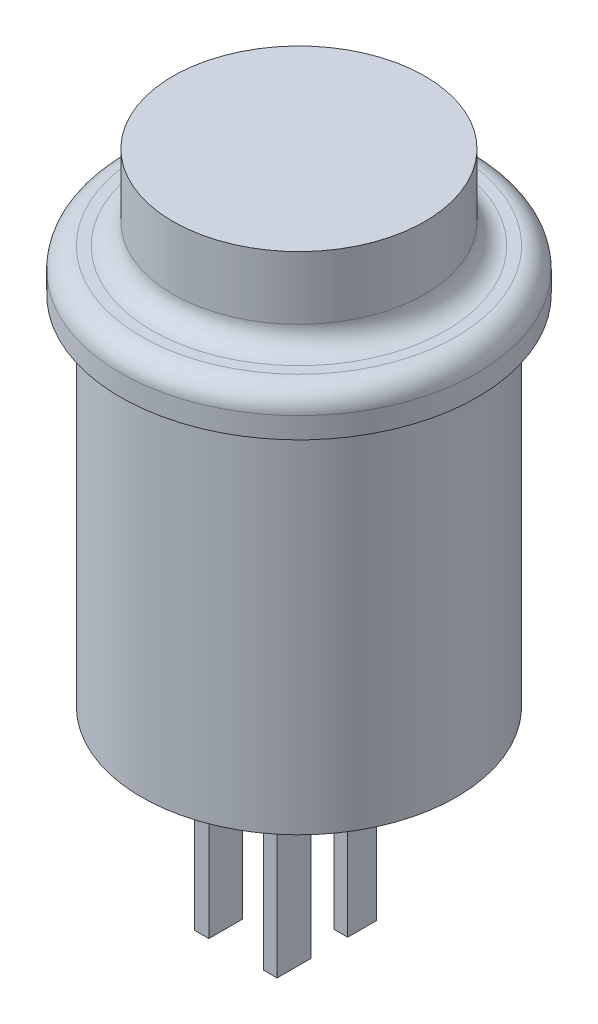
ISO-10303-21;
HEADER;
FILE_DESCRIPTION(('STEP AP214'),'2;1');
FILE_NAME('part.step','',(''),(''),'','','');
FILE_SCHEMA(('AUTOMOTIVE_DESIGN { 1 0 10303 214 1 1 1 1 }'));
ENDSEC;
DATA;
#1=APPLICATION_CONTEXT('core data for automotive mechanical design processes');
#2=APPLICATION_PROTOCOL_DEFINITION('international standard','automotive_design',2000,#1);
#3=PRODUCT_CONTEXT('',#1,'mechanical');
#4=PRODUCT('Part','Part','',(#3));
#5=PRODUCT_RELATED_PRODUCT_CATEGORY('part','',(#4));
#6=PRODUCT_DEFINITION_FORMATION('','',#4);
#7=PRODUCT_DEFINITION_CONTEXT('part definition',#1,'design');
#8=PRODUCT_DEFINITION('design','',#6,#7);
#9=PRODUCT_DEFINITION_SHAPE('','',#8);
#10=(LENGTH_UNIT() NAMED_UNIT(*) SI_UNIT(.MILLI.,.METRE.));
#11=(NAMED_UNIT(*) PLANE_ANGLE_UNIT() SI_UNIT($,.RADIAN.));
#12=(NAMED_UNIT(*) SI_UNIT($,.STERADIAN.) SOLID_ANGLE_UNIT());
#13=UNCERTAINTY_MEASURE_WITH_UNIT(LENGTH_MEASURE(1.E-05),#10,'distance_accuracy_value','');
#14=(GEOMETRIC_REPRESENTATION_CONTEXT(3) GLOBAL_UNCERTAINTY_ASSIGNED_CONTEXT((#13)) GLOBAL_UNIT_ASSIGNED_CONTEXT((#10,
#11,#12)) REPRESENTATION_CONTEXT('',''));
#15=CARTESIAN_POINT('',(0.,0.,0.));
#16=DIRECTION('',(0.,0.,1.));
#17=DIRECTION('',(1.,0.,0.));
#18=AXIS2_PLACEMENT_3D('',#15,#16,#17);
#19=CARTESIAN_POINT('',(0.,-19.,0.));
#20=DIRECTION('',(0.,-1.,0.));
#21=DIRECTION('',(0.,0.,-1.));
#22=AXIS2_PLACEMENT_3D('',#19,#20,#21);
#23=PLANE('',#22);
#24=CARTESIAN_POINT('',(0.,-19.,0.));
#25=DIRECTION('',(0.,-1.,0.));
#26=DIRECTION('',(0.,0.,-1.));
#27=AXIS2_PLACEMENT_3D('',#24,#25,#26);
#28=CIRCLE('',#27,7.5);
#29=CARTESIAN_POINT('',(0.,-19.,-7.5));
#30=VERTEX_POINT('',#29);
#31=EDGE_CURVE('E266',#30,#30,#28,.T.);
#32=ORIENTED_EDGE('',*,*,#31,.T.);
#33=EDGE_LOOP('',(#32));
#34=FACE_BOUND('',#33,.T.);
#35=DIRECTION('',(1.,0.,0.));
#36=VECTOR('',#35,1.);
#37=CARTESIAN_POINT('',(3.03160326075695,-19.,3.12291661198465));
#38=LINE('',#37,#36);
#39=CARTESIAN_POINT('',(3.03160326075695,-19.,3.12291661198465));
#40=VERTEX_POINT('',#39);
#41=CARTESIAN_POINT('',(3.6890593895958,-19.,3.12291661198465));
#42=VERTEX_POINT('',#41);
#43=EDGE_CURVE('E250',#40,#42,#38,.T.);
#44=ORIENTED_EDGE('',*,*,#43,.F.);
#45=DIRECTION('',(0.,0.,-1.));
#46=VECTOR('',#45,1.);
#47=CARTESIAN_POINT('',(3.03160326075695,-19.,4.73003159359074));
#48=LINE('',#47,#46);
#49=CARTESIAN_POINT('',(3.03160326075695,-19.,4.73003159359074));
#50=VERTEX_POINT('',#49);
#51=EDGE_CURVE('E236',#50,#40,#48,.T.);
#52=ORIENTED_EDGE('',*,*,#51,.F.);
#53=DIRECTION('',(-1.,0.,0.));
#54=VECTOR('',#53,1.);
#55=CARTESIAN_POINT('',(3.03160326075695,-19.,4.73003159359074));
#56=LINE('',#55,#54);
#57=CARTESIAN_POINT('',(3.6890593895958,-19.,4.73003159359074));
#58=VERTEX_POINT('',#57);
#59=EDGE_CURVE('E241',#58,#50,#56,.T.);
#60=ORIENTED_EDGE('',*,*,#59,.F.);
#61=DIRECTION('',(0.,0.,1.));
#62=VECTOR('',#61,1.);
#63=CARTESIAN_POINT('',(3.6890593895958,-19.,4.73003159359074));
#64=LINE('',#63,#62);
#65=EDGE_CURVE('E252',#42,#58,#64,.T.);
#66=ORIENTED_EDGE('',*,*,#65,.F.);
#67=EDGE_LOOP('',(#44,#52,#60,#66));
#68=FACE_BOUND('',#67,.T.);
#69=DIRECTION('',(1.,0.,0.));
#70=VECTOR('',#69,1.);
#71=CARTESIAN_POINT('',(-0.255677383437333,-19.,3.12291661198465));
#72=LINE('',#71,#70);
#73=CARTESIAN_POINT('',(-0.255677383437333,-19.,3.12291661198465));
#74=VERTEX_POINT('',#73);
#75=CARTESIAN_POINT('',(0.438304085892571,-19.,3.12291661198465));
#76=VERTEX_POINT('',#75);
#77=EDGE_CURVE('E221',#74,#76,#72,.T.);
#78=ORIENTED_EDGE('',*,*,#77,.F.);
#79=DIRECTION('',(0.,0.,-1.));
#80=VECTOR('',#79,1.);
#81=CARTESIAN_POINT('',(-0.255677383437333,-19.,4.73003159359074));
#82=LINE('',#81,#80);
#83=CARTESIAN_POINT('',(-0.255677383437333,-19.,4.73003159359074));
#84=VERTEX_POINT('',#83);
#85=EDGE_CURVE('E207',#84,#74,#82,.T.);
#86=ORIENTED_EDGE('',*,*,#85,.F.);
#87=DIRECTION('',(-1.,0.,0.));
#88=VECTOR('',#87,1.);
#89=CARTESIAN_POINT('',(-0.255677383437333,-19.,4.73003159359074));
#90=LINE('',#89,#88);
#91=CARTESIAN_POINT('',(0.438304085892571,-19.,4.73003159359074));
#92=VERTEX_POINT('',#91);
#93=EDGE_CURVE('E212',#92,#84,#90,.T.);
#94=ORIENTED_EDGE('',*,*,#93,.F.);
#95=DIRECTION('',(0.,0.,1.));
#96=VECTOR('',#95,1.);
#97=CARTESIAN_POINT('',(0.438304085892571,-19.,4.73003159359074));
#98=LINE('',#97,#96);
#99=EDGE_CURVE('E223',#76,#92,#98,.T.);
#100=ORIENTED_EDGE('',*,*,#99,.F.);
#101=EDGE_LOOP('',(#78,#86,#94,#100));
#102=FACE_BOUND('',#101,.T.);
#103=DIRECTION('',(1.,0.,0.));
#104=VECTOR('',#103,1.);
#105=CARTESIAN_POINT('',(3.03160326075695,-19.,0.));
#106=LINE('',#105,#104);
#107=CARTESIAN_POINT('',(3.03160326075695,-19.,0.));
#108=VERTEX_POINT('',#107);
#109=CARTESIAN_POINT('',(3.6890593895958,-19.,0.));
#110=VERTEX_POINT('',#109);
#111=EDGE_CURVE('E179',#108,#110,#106,.T.);
#112=ORIENTED_EDGE('',*,*,#111,.F.);
#113=DIRECTION('',(0.,0.,-1.));
#114=VECTOR('',#113,1.);
#115=CARTESIAN_POINT('',(3.03160326075695,-19.,1.36970026841437));
#116=LINE('',#115,#114);
#117=CARTESIAN_POINT('',(3.03160326075695,-19.,1.36970026841437));
#118=VERTEX_POINT('',#117);
#119=EDGE_CURVE('E176',#118,#108,#116,.T.);
#120=ORIENTED_EDGE('',*,*,#119,.F.);
#121=DIRECTION('',(-1.,0.,0.));
#122=VECTOR('',#121,1.);
#123=CARTESIAN_POINT('',(3.03160326075695,-19.,1.36970026841437));
#124=LINE('',#123,#122);
#125=CARTESIAN_POINT('',(3.6890593895958,-19.,1.36970026841437));
#126=VERTEX_POINT('',#125);
#127=EDGE_CURVE('E188',#126,#118,#124,.T.);
#128=ORIENTED_EDGE('',*,*,#127,.F.);
#129=DIRECTION('',(0.,0.,1.));
#130=VECTOR('',#129,1.);
#131=CARTESIAN_POINT('',(3.6890593895958,-19.,1.36970026841437));
#132=LINE('',#131,#130);
#133=EDGE_CURVE('E196',#110,#126,#132,.T.);
#134=ORIENTED_EDGE('',*,*,#133,.F.);
#135=EDGE_LOOP('',(#112,#120,#128,#134));
#136=FACE_BOUND('',#135,.T.);
#137=DIRECTION('',(1.,0.,0.));
#138=VECTOR('',#137,1.);
#139=CARTESIAN_POINT('',(-0.255677383437333,-19.,0.));
#140=LINE('',#139,#138);
#141=CARTESIAN_POINT('',(-0.255677383437333,-19.,0.));
#142=VERTEX_POINT('',#141);
#143=CARTESIAN_POINT('',(0.438304085892571,-19.,0.));
#144=VERTEX_POINT('',#143);
#145=EDGE_CURVE('E580',#142,#144,#140,.T.);
#146=ORIENTED_EDGE('',*,*,#145,.F.);
#147=DIRECTION('',(0.,0.,-1.));
#148=VECTOR('',#147,1.);
#149=CARTESIAN_POINT('',(-0.255677383437333,-19.,1.36970026841437));
#150=LINE('',#149,#148);
#151=CARTESIAN_POINT('',(-0.255677383437333,-19.,1.36970026841437));
#152=VERTEX_POINT('',#151);
#153=EDGE_CURVE('E174',#152,#142,#150,.T.);
#154=ORIENTED_EDGE('',*,*,#153,.F.);
#155=DIRECTION('',(-1.,0.,0.));
#156=VECTOR('',#155,1.);
#157=CARTESIAN_POINT('',(-0.255677383437333,-19.,1.36970026841437));
#158=LINE('',#157,#156);
#159=CARTESIAN_POINT('',(0.438304085892571,-19.,1.36970026841437));
#160=VERTEX_POINT('',#159);
#161=EDGE_CURVE('E170',#160,#152,#158,.T.);
#162=ORIENTED_EDGE('',*,*,#161,.F.);
#163=DIRECTION('',(0.,0.,1.));
#164=VECTOR('',#163,1.);
#165=CARTESIAN_POINT('',(0.438304085892571,-19.,1.36970026841437));
#166=LINE('',#165,#164);
#167=EDGE_CURVE('E577',#144,#160,#166,.T.);
#168=ORIENTED_EDGE('',*,*,#167,.F.);
#169=EDGE_LOOP('',(#146,#154,#162,#168));
#170=FACE_BOUND('',#169,.T.);
#171=ADVANCED_FACE('F37',(#34,#68,#102,#136,#170),#23,.T.);
#172=CARTESIAN_POINT('',(0.,4.,0.));
#173=DIRECTION('',(0.,-1.,0.));
#174=DIRECTION('',(0.,0.,-1.));
#175=AXIS2_PLACEMENT_3D('',#172,#173,#174);
#176=CYLINDRICAL_SURFACE('',#175,6.);
#177=CARTESIAN_POINT('',(0.,1.,0.));
#178=DIRECTION('',(0.,-1.,0.));
#179=DIRECTION('',(0.,0.,-1.));
#180=AXIS2_PLACEMENT_3D('',#177,#178,#179);
#181=CIRCLE('',#180,6.);
#182=CARTESIAN_POINT('',(0.,1.,-6.));
#183=VERTEX_POINT('',#182);
#184=EDGE_CURVE('E11',#183,#183,#181,.F.);
#185=ORIENTED_EDGE('',*,*,#184,.T.);
#186=EDGE_LOOP('',(#185));
#187=FACE_BOUND('',#186,.T.);
#188=CARTESIAN_POINT('',(0.,4.,0.));
#189=DIRECTION('',(0.,1.,0.));
#190=DIRECTION('',(0.,0.,1.));
#191=AXIS2_PLACEMENT_3D('',#188,#189,#190);
#192=CIRCLE('',#191,6.);
#193=CARTESIAN_POINT('',(0.,4.,6.));
#194=VERTEX_POINT('',#193);
#195=EDGE_CURVE('E274',#194,#194,#192,.T.);
#196=ORIENTED_EDGE('',*,*,#195,.F.);
#197=EDGE_LOOP('',(#196));
#198=FACE_BOUND('',#197,.T.);
#199=ADVANCED_FACE('F311',(#187,#198),#176,.T.);
#200=CARTESIAN_POINT('',(0.,4.,0.));
#201=DIRECTION('',(0.,1.,0.));
#202=DIRECTION('',(0.,0.,1.));
#203=AXIS2_PLACEMENT_3D('',#200,#201,#202);
#204=PLANE('',#203);
#205=ORIENTED_EDGE('',*,*,#195,.T.);
#206=EDGE_LOOP('',(#205));
#207=FACE_BOUND('',#206,.T.);
#208=ADVANCED_FACE('F297',(#207),#204,.T.);
#209=CARTESIAN_POINT('',(0.,-2.,0.));
#210=DIRECTION('',(0.,1.,0.));
#211=DIRECTION('',(0.,0.,1.));
#212=AXIS2_PLACEMENT_3D('',#209,#210,#211);
#213=CYLINDRICAL_SURFACE('',#212,8.5);
#214=CARTESIAN_POINT('',(0.,-1.,0.));
#215=DIRECTION('',(0.,-1.,0.));
#216=DIRECTION('',(0.,0.,-1.));
#217=AXIS2_PLACEMENT_3D('',#214,#215,#216);
#218=CIRCLE('',#217,8.5);
#219=CARTESIAN_POINT('',(0.,-1.,-8.5));
#220=VERTEX_POINT('',#219);
#221=EDGE_CURVE('E277',#220,#220,#218,.T.);
#222=ORIENTED_EDGE('',*,*,#221,.T.);
#223=EDGE_LOOP('',(#222));
#224=FACE_BOUND('',#223,.T.);
#225=CARTESIAN_POINT('',(0.,-2.,0.));
#226=DIRECTION('',(0.,-1.,0.));
#227=DIRECTION('',(0.,0.,-1.));
#228=AXIS2_PLACEMENT_3D('',#225,#226,#227);
#229=CIRCLE('',#228,8.5);
#230=CARTESIAN_POINT('',(0.,-2.,-8.5));
#231=VERTEX_POINT('',#230);
#232=EDGE_CURVE('E269',#231,#231,#229,.T.);
#233=ORIENTED_EDGE('',*,*,#232,.F.);
#234=EDGE_LOOP('',(#233));
#235=FACE_BOUND('',#234,.T.);
#236=ADVANCED_FACE('F293',(#224,#235),#213,.T.);
#237=CARTESIAN_POINT('',(0.,-2.,0.));
#238=DIRECTION('',(0.,-1.,0.));
#239=DIRECTION('',(0.,0.,-1.));
#240=AXIS2_PLACEMENT_3D('',#237,#238,#239);
#241=PLANE('',#240);
#242=CARTESIAN_POINT('',(0.,-2.,0.));
#243=DIRECTION('',(0.,-1.,0.));
#244=DIRECTION('',(0.,0.,-1.));
#245=AXIS2_PLACEMENT_3D('',#242,#243,#244);
#246=CIRCLE('',#245,7.5);
#247=CARTESIAN_POINT('',(0.,-2.,-7.5));
#248=VERTEX_POINT('',#247);
#249=EDGE_CURVE('E265',#248,#248,#246,.T.);
#250=ORIENTED_EDGE('',*,*,#249,.F.);
#251=EDGE_LOOP('',(#250));
#252=FACE_BOUND('',#251,.T.);
#253=ORIENTED_EDGE('',*,*,#232,.T.);
#254=EDGE_LOOP('',(#253));
#255=FACE_BOUND('',#254,.T.);
#256=ADVANCED_FACE('F296',(#252,#255),#241,.T.);
#257=CARTESIAN_POINT('',(0.,0.,0.));
#258=DIRECTION('',(0.,-1.,0.));
#259=DIRECTION('',(0.,0.,-1.));
#260=AXIS2_PLACEMENT_3D('',#257,#258,#259);
#261=PLANE('',#260);
#262=CARTESIAN_POINT('',(0.,0.,0.));
#263=DIRECTION('',(0.,-1.,0.));
#264=DIRECTION('',(0.,0.,-1.));
#265=AXIS2_PLACEMENT_3D('',#262,#263,#264);
#266=CIRCLE('',#265,7.5);
#267=CARTESIAN_POINT('',(0.,0.,-7.5));
#268=VERTEX_POINT('',#267);
#269=EDGE_CURVE('E45',#268,#268,#266,.F.);
#270=ORIENTED_EDGE('',*,*,#269,.T.);
#271=EDGE_LOOP('',(#270));
#272=FACE_BOUND('',#271,.T.);
#273=CARTESIAN_POINT('',(0.,0.,0.));
#274=DIRECTION('',(0.,-1.,0.));
#275=DIRECTION('',(0.,0.,-1.));
#276=AXIS2_PLACEMENT_3D('',#273,#274,#275);
#277=CIRCLE('',#276,7.);
#278=CARTESIAN_POINT('',(0.,0.,-7.));
#279=VERTEX_POINT('',#278);
#280=EDGE_CURVE('E280',#279,#279,#277,.T.);
#281=ORIENTED_EDGE('',*,*,#280,.T.);
#282=EDGE_LOOP('',(#281));
#283=FACE_BOUND('',#282,.T.);
#284=ADVANCED_FACE('F285',(#272,#283),#261,.F.);
#285=CARTESIAN_POINT('',(0.,-1.,0.));
#286=DIRECTION('',(0.,-1.,0.));
#287=DIRECTION('',(0.,0.,-1.));
#288=AXIS2_PLACEMENT_3D('',#285,#286,#287);
#289=TOROIDAL_SURFACE('',#288,7.5,1.);
#290=ORIENTED_EDGE('',*,*,#269,.F.);
#291=EDGE_LOOP('',(#290));
#292=FACE_BOUND('',#291,.T.);
#293=ORIENTED_EDGE('',*,*,#221,.F.);
#294=EDGE_LOOP('',(#293));
#295=FACE_BOUND('',#294,.T.);
#296=ADVANCED_FACE('F288',(#292,#295),#289,.T.);
#297=CARTESIAN_POINT('',(0.,1.,0.));
#298=DIRECTION('',(0.,-1.,0.));
#299=DIRECTION('',(0.,0.,-1.));
#300=AXIS2_PLACEMENT_3D('',#297,#298,#299);
#301=TOROIDAL_SURFACE('',#300,7.,1.);
#302=ORIENTED_EDGE('',*,*,#184,.F.);
#303=EDGE_LOOP('',(#302));
#304=FACE_BOUND('',#303,.T.);
#305=ORIENTED_EDGE('',*,*,#280,.F.);
#306=EDGE_LOOP('',(#305));
#307=FACE_BOUND('',#306,.T.);
#308=ADVANCED_FACE('F39',(#304,#307),#301,.F.);
#309=CARTESIAN_POINT('',(0.,-19.,0.));
#310=DIRECTION('',(0.,1.,0.));
#311=DIRECTION('',(0.,0.,1.));
#312=AXIS2_PLACEMENT_3D('',#309,#310,#311);
#313=CYLINDRICAL_SURFACE('',#312,7.5);
#314=ORIENTED_EDGE('',*,*,#31,.F.);
#315=EDGE_LOOP('',(#314));
#316=FACE_BOUND('',#315,.T.);
#317=ORIENTED_EDGE('',*,*,#249,.T.);
#318=EDGE_LOOP('',(#317));
#319=FACE_BOUND('',#318,.T.);
#320=ADVANCED_FACE('F323',(#316,#319),#313,.T.);
#321=CARTESIAN_POINT('',(3.03160326075695,-26.,4.73003159359074));
#322=DIRECTION('',(1.,0.,0.));
#323=DIRECTION('',(0.,0.,-1.));
#324=AXIS2_PLACEMENT_3D('',#321,#322,#323);
#325=PLANE('',#324);
#326=ORIENTED_EDGE('',*,*,#51,.T.);
#327=DIRECTION('',(0.,1.,0.));
#328=VECTOR('',#327,1.);
#329=CARTESIAN_POINT('',(3.03160326075695,-26.,3.12291661198465));
#330=LINE('',#329,#328);
#331=CARTESIAN_POINT('',(3.03160326075695,-26.,3.12291661198465));
#332=VERTEX_POINT('',#331);
#333=EDGE_CURVE('E263',#332,#40,#330,.T.);
#334=ORIENTED_EDGE('',*,*,#333,.F.);
#335=DIRECTION('',(0.,0.,-1.));
#336=VECTOR('',#335,1.);
#337=CARTESIAN_POINT('',(3.03160326075695,-26.,4.73003159359074));
#338=LINE('',#337,#336);
#339=CARTESIAN_POINT('',(3.03160326075695,-26.,4.73003159359074));
#340=VERTEX_POINT('',#339);
#341=EDGE_CURVE('E237',#340,#332,#338,.T.);
#342=ORIENTED_EDGE('',*,*,#341,.F.);
#343=DIRECTION('',(0.,1.,0.));
#344=VECTOR('',#343,1.);
#345=CARTESIAN_POINT('',(3.03160326075695,-26.,4.73003159359074));
#346=LINE('',#345,#344);
#347=EDGE_CURVE('E247',#340,#50,#346,.T.);
#348=ORIENTED_EDGE('',*,*,#347,.T.);
#349=EDGE_LOOP('',(#326,#334,#342,#348));
#350=FACE_BOUND('',#349,.T.);
#351=ADVANCED_FACE('F321',(#350),#325,.F.);
#352=CARTESIAN_POINT('',(3.03160326075695,-26.,3.12291661198465));
#353=DIRECTION('',(0.,0.,1.));
#354=DIRECTION('',(1.,0.,0.));
#355=AXIS2_PLACEMENT_3D('',#352,#353,#354);
#356=PLANE('',#355);
#357=ORIENTED_EDGE('',*,*,#43,.T.);
#358=DIRECTION('',(0.,1.,0.));
#359=VECTOR('',#358,1.);
#360=CARTESIAN_POINT('',(3.6890593895958,-26.,3.12291661198465));
#361=LINE('',#360,#359);
#362=CARTESIAN_POINT('',(3.6890593895958,-26.,3.12291661198465));
#363=VERTEX_POINT('',#362);
#364=EDGE_CURVE('E260',#363,#42,#361,.T.);
#365=ORIENTED_EDGE('',*,*,#364,.F.);
#366=DIRECTION('',(1.,0.,0.));
#367=VECTOR('',#366,1.);
#368=CARTESIAN_POINT('',(3.03160326075695,-26.,3.12291661198465));
#369=LINE('',#368,#367);
#370=EDGE_CURVE('E240',#332,#363,#369,.T.);
#371=ORIENTED_EDGE('',*,*,#370,.F.);
#372=ORIENTED_EDGE('',*,*,#333,.T.);
#373=EDGE_LOOP('',(#357,#365,#371,#372));
#374=FACE_BOUND('',#373,.T.);
#375=ADVANCED_FACE('F330',(#374),#356,.F.);
#376=CARTESIAN_POINT('',(3.6890593895958,-26.,4.73003159359074));
#377=DIRECTION('',(-1.,0.,0.));
#378=DIRECTION('',(0.,0.,1.));
#379=AXIS2_PLACEMENT_3D('',#376,#377,#378);
#380=PLANE('',#379);
#381=ORIENTED_EDGE('',*,*,#65,.T.);
#382=DIRECTION('',(0.,1.,0.));
#383=VECTOR('',#382,1.);
#384=CARTESIAN_POINT('',(3.6890593895958,-26.,4.73003159359074));
#385=LINE('',#384,#383);
#386=CARTESIAN_POINT('',(3.6890593895958,-26.,4.73003159359074));
#387=VERTEX_POINT('',#386);
#388=EDGE_CURVE('E258',#387,#58,#385,.T.);
#389=ORIENTED_EDGE('',*,*,#388,.F.);
#390=DIRECTION('',(0.,0.,1.));
#391=VECTOR('',#390,1.);
#392=CARTESIAN_POINT('',(3.6890593895958,-26.,4.73003159359074));
#393=LINE('',#392,#391);
#394=EDGE_CURVE('E243',#363,#387,#393,.T.);
#395=ORIENTED_EDGE('',*,*,#394,.F.);
#396=ORIENTED_EDGE('',*,*,#364,.T.);
#397=EDGE_LOOP('',(#381,#389,#395,#396));
#398=FACE_BOUND('',#397,.T.);
#399=ADVANCED_FACE('F398',(#398),#380,.F.);
#400=CARTESIAN_POINT('',(3.03160326075695,-26.,4.73003159359074));
#401=DIRECTION('',(0.,0.,-1.));
#402=DIRECTION('',(-1.,0.,0.));
#403=AXIS2_PLACEMENT_3D('',#400,#401,#402);
#404=PLANE('',#403);
#405=ORIENTED_EDGE('',*,*,#59,.T.);
#406=ORIENTED_EDGE('',*,*,#347,.F.);
#407=DIRECTION('',(-1.,0.,0.));
#408=VECTOR('',#407,1.);
#409=CARTESIAN_POINT('',(3.03160326075695,-26.,4.73003159359074));
#410=LINE('',#409,#408);
#411=EDGE_CURVE('E245',#387,#340,#410,.T.);
#412=ORIENTED_EDGE('',*,*,#411,.F.);
#413=ORIENTED_EDGE('',*,*,#388,.T.);
#414=EDGE_LOOP('',(#405,#406,#412,#413));
#415=FACE_BOUND('',#414,.T.);
#416=ADVANCED_FACE('F407',(#415),#404,.F.);
#417=CARTESIAN_POINT('',(0.,-26.,0.));
#418=DIRECTION('',(0.,-1.,0.));
#419=DIRECTION('',(0.,0.,-1.));
#420=AXIS2_PLACEMENT_3D('',#417,#418,#419);
#421=PLANE('',#420);
#422=ORIENTED_EDGE('',*,*,#341,.T.);
#423=ORIENTED_EDGE('',*,*,#370,.T.);
#424=ORIENTED_EDGE('',*,*,#394,.T.);
#425=ORIENTED_EDGE('',*,*,#411,.T.);
#426=EDGE_LOOP('',(#422,#423,#424,#425));
#427=FACE_BOUND('',#426,.T.);
#428=ADVANCED_FACE('F417',(#427),#421,.T.);
#429=CARTESIAN_POINT('',(-0.255677383437333,-26.,4.73003159359074));
#430=DIRECTION('',(1.,0.,0.));
#431=DIRECTION('',(0.,0.,-1.));
#432=AXIS2_PLACEMENT_3D('',#429,#430,#431);
#433=PLANE('',#432);
#434=ORIENTED_EDGE('',*,*,#85,.T.);
#435=DIRECTION('',(0.,1.,0.));
#436=VECTOR('',#435,1.);
#437=CARTESIAN_POINT('',(-0.255677383437333,-26.,3.12291661198465));
#438=LINE('',#437,#436);
#439=CARTESIAN_POINT('',(-0.255677383437333,-26.,3.12291661198465));
#440=VERTEX_POINT('',#439);
#441=EDGE_CURVE('E234',#440,#74,#438,.T.);
#442=ORIENTED_EDGE('',*,*,#441,.F.);
#443=DIRECTION('',(0.,0.,-1.));
#444=VECTOR('',#443,1.);
#445=CARTESIAN_POINT('',(-0.255677383437333,-26.,4.73003159359074));
#446=LINE('',#445,#444);
#447=CARTESIAN_POINT('',(-0.255677383437333,-26.,4.73003159359074));
#448=VERTEX_POINT('',#447);
#449=EDGE_CURVE('E208',#448,#440,#446,.T.);
#450=ORIENTED_EDGE('',*,*,#449,.F.);
#451=DIRECTION('',(0.,1.,0.));
#452=VECTOR('',#451,1.);
#453=CARTESIAN_POINT('',(-0.255677383437333,-26.,4.73003159359074));
#454=LINE('',#453,#452);
#455=EDGE_CURVE('E218',#448,#84,#454,.T.);
#456=ORIENTED_EDGE('',*,*,#455,.T.);
#457=EDGE_LOOP('',(#434,#442,#450,#456));
#458=FACE_BOUND('',#457,.T.);
#459=ADVANCED_FACE('F427',(#458),#433,.F.);
#460=CARTESIAN_POINT('',(-0.255677383437333,-26.,3.12291661198465));
#461=DIRECTION('',(0.,0.,1.));
#462=DIRECTION('',(1.,0.,0.));
#463=AXIS2_PLACEMENT_3D('',#460,#461,#462);
#464=PLANE('',#463);
#465=ORIENTED_EDGE('',*,*,#77,.T.);
#466=DIRECTION('',(0.,1.,0.));
#467=VECTOR('',#466,1.);
#468=CARTESIAN_POINT('',(0.438304085892571,-26.,3.12291661198465));
#469=LINE('',#468,#467);
#470=CARTESIAN_POINT('',(0.438304085892571,-26.,3.12291661198465));
#471=VERTEX_POINT('',#470);
#472=EDGE_CURVE('E231',#471,#76,#469,.T.);
#473=ORIENTED_EDGE('',*,*,#472,.F.);
#474=DIRECTION('',(1.,0.,0.));
#475=VECTOR('',#474,1.);
#476=CARTESIAN_POINT('',(-0.255677383437333,-26.,3.12291661198465));
#477=LINE('',#476,#475);
#478=EDGE_CURVE('E211',#440,#471,#477,.T.);
#479=ORIENTED_EDGE('',*,*,#478,.F.);
#480=ORIENTED_EDGE('',*,*,#441,.T.);
#481=EDGE_LOOP('',(#465,#473,#479,#480));
#482=FACE_BOUND('',#481,.T.);
#483=ADVANCED_FACE('F437',(#482),#464,.F.);
#484=CARTESIAN_POINT('',(0.438304085892571,-26.,4.73003159359074));
#485=DIRECTION('',(-1.,0.,0.));
#486=DIRECTION('',(0.,0.,1.));
#487=AXIS2_PLACEMENT_3D('',#484,#485,#486);
#488=PLANE('',#487);
#489=ORIENTED_EDGE('',*,*,#99,.T.);
#490=DIRECTION('',(0.,1.,0.));
#491=VECTOR('',#490,1.);
#492=CARTESIAN_POINT('',(0.438304085892571,-26.,4.73003159359074));
#493=LINE('',#492,#491);
#494=CARTESIAN_POINT('',(0.438304085892571,-26.,4.73003159359074));
#495=VERTEX_POINT('',#494);
#496=EDGE_CURVE('E229',#495,#92,#493,.T.);
#497=ORIENTED_EDGE('',*,*,#496,.F.);
#498=DIRECTION('',(0.,0.,1.));
#499=VECTOR('',#498,1.);
#500=CARTESIAN_POINT('',(0.438304085892571,-26.,4.73003159359074));
#501=LINE('',#500,#499);
#502=EDGE_CURVE('E214',#471,#495,#501,.T.);
#503=ORIENTED_EDGE('',*,*,#502,.F.);
#504=ORIENTED_EDGE('',*,*,#472,.T.);
#505=EDGE_LOOP('',(#489,#497,#503,#504));
#506=FACE_BOUND('',#505,.T.);
#507=ADVANCED_FACE('F447',(#506),#488,.F.);
#508=CARTESIAN_POINT('',(-0.255677383437333,-26.,4.73003159359074));
#509=DIRECTION('',(0.,0.,-1.));
#510=DIRECTION('',(-1.,0.,0.));
#511=AXIS2_PLACEMENT_3D('',#508,#509,#510);
#512=PLANE('',#511);
#513=ORIENTED_EDGE('',*,*,#93,.T.);
#514=ORIENTED_EDGE('',*,*,#455,.F.);
#515=DIRECTION('',(-1.,0.,0.));
#516=VECTOR('',#515,1.);
#517=CARTESIAN_POINT('',(-0.255677383437333,-26.,4.73003159359074));
#518=LINE('',#517,#516);
#519=EDGE_CURVE('E216',#495,#448,#518,.T.);
#520=ORIENTED_EDGE('',*,*,#519,.F.);
#521=ORIENTED_EDGE('',*,*,#496,.T.);
#522=EDGE_LOOP('',(#513,#514,#520,#521));
#523=FACE_BOUND('',#522,.T.);
#524=ADVANCED_FACE('F457',(#523),#512,.F.);
#525=CARTESIAN_POINT('',(0.,-26.,0.));
#526=DIRECTION('',(0.,-1.,0.));
#527=DIRECTION('',(0.,0.,-1.));
#528=AXIS2_PLACEMENT_3D('',#525,#526,#527);
#529=PLANE('',#528);
#530=ORIENTED_EDGE('',*,*,#449,.T.);
#531=ORIENTED_EDGE('',*,*,#478,.T.);
#532=ORIENTED_EDGE('',*,*,#502,.T.);
#533=ORIENTED_EDGE('',*,*,#519,.T.);
#534=EDGE_LOOP('',(#530,#531,#532,#533));
#535=FACE_BOUND('',#534,.T.);
#536=ADVANCED_FACE('F467',(#535),#529,.T.);
#537=CARTESIAN_POINT('',(3.03160326075695,-26.,1.36970026841437));
#538=DIRECTION('',(1.,0.,0.));
#539=DIRECTION('',(0.,0.,-1.));
#540=AXIS2_PLACEMENT_3D('',#537,#538,#539);
#541=PLANE('',#540);
#542=ORIENTED_EDGE('',*,*,#119,.T.);
#543=DIRECTION('',(0.,1.,0.));
#544=VECTOR('',#543,1.);
#545=CARTESIAN_POINT('',(3.03160326075695,-26.,0.));
#546=LINE('',#545,#544);
#547=CARTESIAN_POINT('',(3.03160326075695,-26.,0.));
#548=VERTEX_POINT('',#547);
#549=EDGE_CURVE('E205',#548,#108,#546,.T.);
#550=ORIENTED_EDGE('',*,*,#549,.F.);
#551=DIRECTION('',(0.,0.,-1.));
#552=VECTOR('',#551,1.);
#553=CARTESIAN_POINT('',(3.03160326075695,-26.,1.36970026841437));
#554=LINE('',#553,#552);
#555=CARTESIAN_POINT('',(3.03160326075695,-26.,1.36970026841437));
#556=VERTEX_POINT('',#555);
#557=EDGE_CURVE('E184',#556,#548,#554,.T.);
#558=ORIENTED_EDGE('',*,*,#557,.F.);
#559=DIRECTION('',(0.,1.,0.));
#560=VECTOR('',#559,1.);
#561=CARTESIAN_POINT('',(3.03160326075695,-26.,1.36970026841437));
#562=LINE('',#561,#560);
#563=EDGE_CURVE('E193',#556,#118,#562,.T.);
#564=ORIENTED_EDGE('',*,*,#563,.T.);
#565=EDGE_LOOP('',(#542,#550,#558,#564));
#566=FACE_BOUND('',#565,.T.);
#567=ADVANCED_FACE('F477',(#566),#541,.F.);
#568=CARTESIAN_POINT('',(3.03160326075695,-26.,0.));
#569=DIRECTION('',(0.,0.,1.));
#570=DIRECTION('',(1.,0.,0.));
#571=AXIS2_PLACEMENT_3D('',#568,#569,#570);
#572=PLANE('',#571);
#573=ORIENTED_EDGE('',*,*,#111,.T.);
#574=DIRECTION('',(0.,1.,0.));
#575=VECTOR('',#574,1.);
#576=CARTESIAN_POINT('',(3.6890593895958,-26.,0.));
#577=LINE('',#576,#575);
#578=CARTESIAN_POINT('',(3.6890593895958,-26.,0.));
#579=VERTEX_POINT('',#578);
#580=EDGE_CURVE('E202',#579,#110,#577,.T.);
#581=ORIENTED_EDGE('',*,*,#580,.F.);
#582=DIRECTION('',(1.,0.,0.));
#583=VECTOR('',#582,1.);
#584=CARTESIAN_POINT('',(3.03160326075695,-26.,0.));
#585=LINE('',#584,#583);
#586=EDGE_CURVE('E187',#548,#579,#585,.T.);
#587=ORIENTED_EDGE('',*,*,#586,.F.);
#588=ORIENTED_EDGE('',*,*,#549,.T.);
#589=EDGE_LOOP('',(#573,#581,#587,#588));
#590=FACE_BOUND('',#589,.T.);
#591=ADVANCED_FACE('F487',(#590),#572,.F.);
#592=CARTESIAN_POINT('',(3.6890593895958,-26.,1.36970026841437));
#593=DIRECTION('',(-1.,0.,0.));
#594=DIRECTION('',(0.,0.,1.));
#595=AXIS2_PLACEMENT_3D('',#592,#593,#594);
#596=PLANE('',#595);
#597=ORIENTED_EDGE('',*,*,#133,.T.);
#598=DIRECTION('',(0.,1.,0.));
#599=VECTOR('',#598,1.);
#600=CARTESIAN_POINT('',(3.6890593895958,-26.,1.36970026841437));
#601=LINE('',#600,#599);
#602=CARTESIAN_POINT('',(3.6890593895958,-26.,1.36970026841437));
#603=VERTEX_POINT('',#602);
#604=EDGE_CURVE('E60',#603,#126,#601,.T.);
#605=ORIENTED_EDGE('',*,*,#604,.F.);
#606=DIRECTION('',(0.,0.,1.));
#607=VECTOR('',#606,1.);
#608=CARTESIAN_POINT('',(3.6890593895958,-26.,1.36970026841437));
#609=LINE('',#608,#607);
#610=EDGE_CURVE('E190',#579,#603,#609,.T.);
#611=ORIENTED_EDGE('',*,*,#610,.F.);
#612=ORIENTED_EDGE('',*,*,#580,.T.);
#613=EDGE_LOOP('',(#597,#605,#611,#612));
#614=FACE_BOUND('',#613,.T.);
#615=ADVANCED_FACE('F497',(#614),#596,.F.);
#616=CARTESIAN_POINT('',(3.03160326075695,-26.,1.36970026841437));
#617=DIRECTION('',(0.,0.,-1.));
#618=DIRECTION('',(-1.,0.,0.));
#619=AXIS2_PLACEMENT_3D('',#616,#617,#618);
#620=PLANE('',#619);
#621=ORIENTED_EDGE('',*,*,#127,.T.);
#622=ORIENTED_EDGE('',*,*,#563,.F.);
#623=DIRECTION('',(-1.,0.,0.));
#624=VECTOR('',#623,1.);
#625=CARTESIAN_POINT('',(3.03160326075695,-26.,1.36970026841437));
#626=LINE('',#625,#624);
#627=EDGE_CURVE('E192',#603,#556,#626,.T.);
#628=ORIENTED_EDGE('',*,*,#627,.F.);
#629=ORIENTED_EDGE('',*,*,#604,.T.);
#630=EDGE_LOOP('',(#621,#622,#628,#629));
#631=FACE_BOUND('',#630,.T.);
#632=ADVANCED_FACE('F507',(#631),#620,.F.);
#633=CARTESIAN_POINT('',(0.,-26.,0.));
#634=DIRECTION('',(0.,-1.,0.));
#635=DIRECTION('',(0.,0.,-1.));
#636=AXIS2_PLACEMENT_3D('',#633,#634,#635);
#637=PLANE('',#636);
#638=ORIENTED_EDGE('',*,*,#557,.T.);
#639=ORIENTED_EDGE('',*,*,#586,.T.);
#640=ORIENTED_EDGE('',*,*,#610,.T.);
#641=ORIENTED_EDGE('',*,*,#627,.T.);
#642=EDGE_LOOP('',(#638,#639,#640,#641));
#643=FACE_BOUND('',#642,.T.);
#644=ADVANCED_FACE('F517',(#643),#637,.T.);
#645=CARTESIAN_POINT('',(-0.255677383437333,-26.,1.36970026841437));
#646=DIRECTION('',(1.,0.,0.));
#647=DIRECTION('',(0.,0.,-1.));
#648=AXIS2_PLACEMENT_3D('',#645,#646,#647);
#649=PLANE('',#648);
#650=ORIENTED_EDGE('',*,*,#153,.T.);
#651=DIRECTION('',(0.,1.,0.));
#652=VECTOR('',#651,1.);
#653=CARTESIAN_POINT('',(-0.255677383437333,-26.,0.));
#654=LINE('',#653,#652);
#655=CARTESIAN_POINT('',(-0.255677383437333,-26.,0.));
#656=VERTEX_POINT('',#655);
#657=EDGE_CURVE('E155',#656,#142,#654,.T.);
#658=ORIENTED_EDGE('',*,*,#657,.F.);
#659=DIRECTION('',(0.,0.,-1.));
#660=VECTOR('',#659,1.);
#661=CARTESIAN_POINT('',(-0.255677383437333,-26.,1.36970026841437));
#662=LINE('',#661,#660);
#663=CARTESIAN_POINT('',(-0.255677383437333,-26.,1.36970026841437));
#664=VERTEX_POINT('',#663);
#665=EDGE_CURVE('E162',#664,#656,#662,.T.);
#666=ORIENTED_EDGE('',*,*,#665,.F.);
#667=DIRECTION('',(0.,1.,0.));
#668=VECTOR('',#667,1.);
#669=CARTESIAN_POINT('',(-0.255677383437333,-26.,1.36970026841437));
#670=LINE('',#669,#668);
#671=EDGE_CURVE('E574',#664,#152,#670,.T.);
#672=ORIENTED_EDGE('',*,*,#671,.T.);
#673=EDGE_LOOP('',(#650,#658,#666,#672));
#674=FACE_BOUND('',#673,.T.);
#675=ADVANCED_FACE('F172',(#674),#649,.F.);
#676=CARTESIAN_POINT('',(-0.255677383437333,-26.,0.));
#677=DIRECTION('',(0.,0.,1.));
#678=DIRECTION('',(1.,0.,0.));
#679=AXIS2_PLACEMENT_3D('',#676,#677,#678);
#680=PLANE('',#679);
#681=ORIENTED_EDGE('',*,*,#145,.T.);
#682=DIRECTION('',(0.,1.,0.));
#683=VECTOR('',#682,1.);
#684=CARTESIAN_POINT('',(0.438304085892571,-26.,0.));
#685=LINE('',#684,#683);
#686=CARTESIAN_POINT('',(0.438304085892571,-26.,0.));
#687=VERTEX_POINT('',#686);
#688=EDGE_CURVE('E158',#687,#144,#685,.T.);
#689=ORIENTED_EDGE('',*,*,#688,.F.);
#690=DIRECTION('',(1.,0.,0.));
#691=VECTOR('',#690,1.);
#692=CARTESIAN_POINT('',(-0.255677383437333,-26.,0.));
#693=LINE('',#692,#691);
#694=EDGE_CURVE('E151',#656,#687,#693,.T.);
#695=ORIENTED_EDGE('',*,*,#694,.F.);
#696=ORIENTED_EDGE('',*,*,#657,.T.);
#697=EDGE_LOOP('',(#681,#689,#695,#696));
#698=FACE_BOUND('',#697,.T.);
#699=ADVANCED_FACE('F153',(#698),#680,.F.);
#700=CARTESIAN_POINT('',(0.438304085892571,-26.,1.36970026841437));
#701=DIRECTION('',(-1.,0.,0.));
#702=DIRECTION('',(0.,0.,1.));
#703=AXIS2_PLACEMENT_3D('',#700,#701,#702);
#704=PLANE('',#703);
#705=ORIENTED_EDGE('',*,*,#167,.T.);
#706=DIRECTION('',(0.,1.,0.));
#707=VECTOR('',#706,1.);
#708=CARTESIAN_POINT('',(0.438304085892571,-26.,1.36970026841437));
#709=LINE('',#708,#707);
#710=CARTESIAN_POINT('',(0.438304085892571,-26.,1.36970026841437));
#711=VERTEX_POINT('',#710);
#712=EDGE_CURVE('E52',#711,#160,#709,.T.);
#713=ORIENTED_EDGE('',*,*,#712,.F.);
#714=DIRECTION('',(0.,0.,1.));
#715=VECTOR('',#714,1.);
#716=CARTESIAN_POINT('',(0.438304085892571,-26.,1.36970026841437));
#717=LINE('',#716,#715);
#718=EDGE_CURVE('E161',#687,#711,#717,.T.);
#719=ORIENTED_EDGE('',*,*,#718,.F.);
#720=ORIENTED_EDGE('',*,*,#688,.T.);
#721=EDGE_LOOP('',(#705,#713,#719,#720));
#722=FACE_BOUND('',#721,.T.);
#723=ADVANCED_FACE('F543',(#722),#704,.F.);
#724=CARTESIAN_POINT('',(-0.255677383437333,-26.,1.36970026841437));
#725=DIRECTION('',(0.,0.,-1.));
#726=DIRECTION('',(-1.,0.,0.));
#727=AXIS2_PLACEMENT_3D('',#724,#725,#726);
#728=PLANE('',#727);
#729=ORIENTED_EDGE('',*,*,#161,.T.);
#730=ORIENTED_EDGE('',*,*,#671,.F.);
#731=DIRECTION('',(-1.,0.,0.));
#732=VECTOR('',#731,1.);
#733=CARTESIAN_POINT('',(-0.255677383437333,-26.,1.36970026841437));
#734=LINE('',#733,#732);
#735=EDGE_CURVE('E166',#711,#664,#734,.T.);
#736=ORIENTED_EDGE('',*,*,#735,.F.);
#737=ORIENTED_EDGE('',*,*,#712,.T.);
#738=EDGE_LOOP('',(#729,#730,#736,#737));
#739=FACE_BOUND('',#738,.T.);
#740=ADVANCED_FACE('F552',(#739),#728,.F.);
#741=CARTESIAN_POINT('',(0.,-26.,0.));
#742=DIRECTION('',(0.,-1.,0.));
#743=DIRECTION('',(0.,0.,-1.));
#744=AXIS2_PLACEMENT_3D('',#741,#742,#743);
#745=PLANE('',#744);
#746=ORIENTED_EDGE('',*,*,#665,.T.);
#747=ORIENTED_EDGE('',*,*,#694,.T.);
#748=ORIENTED_EDGE('',*,*,#718,.T.);
#749=ORIENTED_EDGE('',*,*,#735,.T.);
#750=EDGE_LOOP('',(#746,#747,#748,#749));
#751=FACE_BOUND('',#750,.T.);
#752=ADVANCED_FACE('F165',(#751),#745,.T.);
#753=CLOSED_SHELL('',(#171,#199,#208,#236,#256,#284,#296,#308,#320,#351,#375,#399,#416,#428,
#459,#483,#507,#524,#536,#567,#591,#615,#632,#644,#675,#699,#723,#740,#752));
#754=MANIFOLD_SOLID_BREP('B2',#753);
#755=ADVANCED_BREP_SHAPE_REPRESENTATION('',(#18,#754),#14);
#756=SHAPE_DEFINITION_REPRESENTATION(#9,#755);
ENDSEC;
END-ISO-10303-21;
